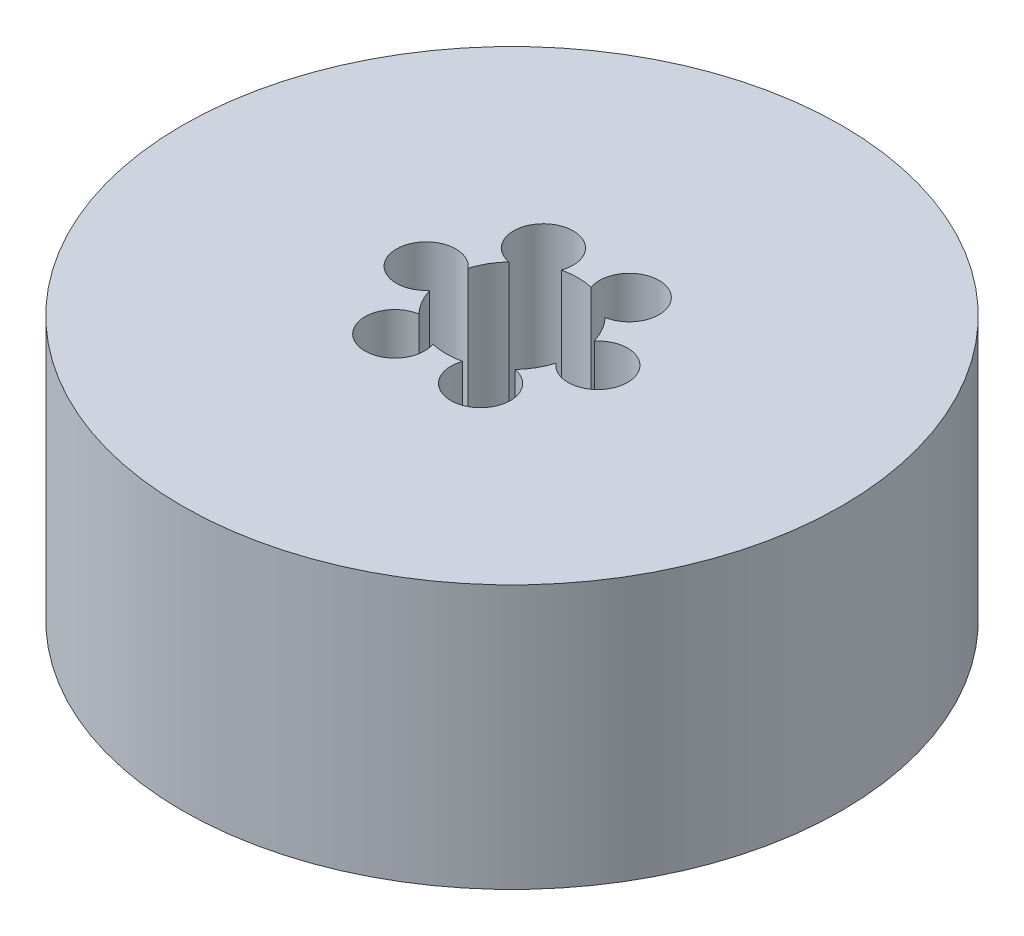
ISO-10303-21;
HEADER;
FILE_DESCRIPTION(('STEP AP214'),'2;1');
FILE_NAME('part.step','',(''),(''),'','','');
FILE_SCHEMA(('AUTOMOTIVE_DESIGN { 1 0 10303 214 1 1 1 1 }'));
ENDSEC;
DATA;
#1=APPLICATION_CONTEXT('core data for automotive mechanical design processes');
#2=APPLICATION_PROTOCOL_DEFINITION('international standard','automotive_design',2000,#1);
#3=PRODUCT_CONTEXT('',#1,'mechanical');
#4=PRODUCT('Part','Part','',(#3));
#5=PRODUCT_RELATED_PRODUCT_CATEGORY('part','',(#4));
#6=PRODUCT_DEFINITION_FORMATION('','',#4);
#7=PRODUCT_DEFINITION_CONTEXT('part definition',#1,'design');
#8=PRODUCT_DEFINITION('design','',#6,#7);
#9=PRODUCT_DEFINITION_SHAPE('','',#8);
#10=(LENGTH_UNIT() NAMED_UNIT(*) SI_UNIT(.MILLI.,.METRE.));
#11=(NAMED_UNIT(*) PLANE_ANGLE_UNIT() SI_UNIT($,.RADIAN.));
#12=(NAMED_UNIT(*) SI_UNIT($,.STERADIAN.) SOLID_ANGLE_UNIT());
#13=UNCERTAINTY_MEASURE_WITH_UNIT(LENGTH_MEASURE(1.E-05),#10,'distance_accuracy_value','');
#14=(GEOMETRIC_REPRESENTATION_CONTEXT(3) GLOBAL_UNCERTAINTY_ASSIGNED_CONTEXT((#13)) GLOBAL_UNIT_ASSIGNED_CONTEXT((#10,
#11,#12)) REPRESENTATION_CONTEXT('',''));
#15=CARTESIAN_POINT('',(0.,0.,0.));
#16=DIRECTION('',(0.,0.,1.));
#17=DIRECTION('',(1.,0.,0.));
#18=AXIS2_PLACEMENT_3D('',#15,#16,#17);
#19=CARTESIAN_POINT('',(0.,20.,0.));
#20=DIRECTION('',(0.,-1.,0.));
#21=DIRECTION('',(0.,0.,-1.));
#22=AXIS2_PLACEMENT_3D('',#19,#20,#21);
#23=CYLINDRICAL_SURFACE('',#22,25.);
#24=CARTESIAN_POINT('',(0.,20.,0.));
#25=DIRECTION('',(0.,1.,0.));
#26=DIRECTION('',(0.,0.,1.));
#27=AXIS2_PLACEMENT_3D('',#24,#25,#26);
#28=CIRCLE('',#27,25.);
#29=CARTESIAN_POINT('',(0.,20.,25.));
#30=VERTEX_POINT('',#29);
#31=EDGE_CURVE('E171',#30,#30,#28,.T.);
#32=ORIENTED_EDGE('',*,*,#31,.F.);
#33=EDGE_LOOP('',(#32));
#34=FACE_BOUND('',#33,.T.);
#35=CARTESIAN_POINT('',(0.,0.,0.));
#36=DIRECTION('',(0.,1.,0.));
#37=DIRECTION('',(0.,0.,1.));
#38=AXIS2_PLACEMENT_3D('',#35,#36,#37);
#39=CIRCLE('',#38,25.);
#40=CARTESIAN_POINT('',(0.,0.,25.));
#41=VERTEX_POINT('',#40);
#42=EDGE_CURVE('E157',#41,#41,#39,.T.);
#43=ORIENTED_EDGE('',*,*,#42,.T.);
#44=EDGE_LOOP('',(#43));
#45=FACE_BOUND('',#44,.T.);
#46=ADVANCED_FACE('F39',(#34,#45),#23,.T.);
#47=CARTESIAN_POINT('',(0.,20.,0.));
#48=DIRECTION('',(0.,1.,0.));
#49=DIRECTION('',(0.,0.,1.));
#50=AXIS2_PLACEMENT_3D('',#47,#48,#49);
#51=PLANE('',#50);
#52=CARTESIAN_POINT('',(-3.25438526965121,20.,-5.63676063443948));
#53=DIRECTION('',(0.,1.,0.));
#54=DIRECTION('',(-0.866025403784433,0.,0.50000000000001));
#55=AXIS2_PLACEMENT_3D('',#52,#53,#54);
#56=CIRCLE('',#55,2.25778985265546);
#57=CARTESIAN_POINT('',(-1.13060215816888,20.,-4.87049676726552));
#58=VERTEX_POINT('',#57);
#59=CARTESIAN_POINT('',(-3.65267285041757,20.,-3.41437857418043));
#60=VERTEX_POINT('',#59);
#61=EDGE_CURVE('E214',#58,#60,#56,.T.);
#62=ORIENTED_EDGE('',*,*,#61,.F.);
#63=CARTESIAN_POINT('',(0.,20.,0.));
#64=DIRECTION('',(0.,1.,0.));
#65=DIRECTION('',(0.,0.,1.));
#66=AXIS2_PLACEMENT_3D('',#63,#64,#65);
#67=CIRCLE('',#66,5.);
#68=CARTESIAN_POINT('',(1.13060215816877,20.,-4.87049676726554));
#69=VERTEX_POINT('',#68);
#70=EDGE_CURVE('E272',#69,#58,#67,.T.);
#71=ORIENTED_EDGE('',*,*,#70,.F.);
#72=CARTESIAN_POINT('',(3.25438526965109,20.,-5.63676063443955));
#73=DIRECTION('',(0.,1.,0.));
#74=DIRECTION('',(-0.866025403784443,0.,-0.499999999999992));
#75=AXIS2_PLACEMENT_3D('',#72,#73,#74);
#76=CIRCLE('',#75,2.25778985265546);
#77=CARTESIAN_POINT('',(3.6526728504175,20.,-3.41437857418051));
#78=VERTEX_POINT('',#77);
#79=EDGE_CURVE('E285',#78,#69,#76,.T.);
#80=ORIENTED_EDGE('',*,*,#79,.F.);
#81=CARTESIAN_POINT('',(4.78327500858635,20.,-1.45611819308506));
#82=VERTEX_POINT('',#81);
#83=EDGE_CURVE('E165',#82,#78,#67,.T.);
#84=ORIENTED_EDGE('',*,*,#83,.F.);
#85=CARTESIAN_POINT('',(6.50877053930228,20.,0.));
#86=DIRECTION('',(0.,1.,0.));
#87=DIRECTION('',(0.,0.,-1.));
#88=AXIS2_PLACEMENT_3D('',#85,#86,#87);
#89=CIRCLE('',#88,2.25778985265546);
#90=CARTESIAN_POINT('',(4.78327500858635,20.,1.45611819308506));
#91=VERTEX_POINT('',#90);
#92=EDGE_CURVE('E281',#91,#82,#89,.T.);
#93=ORIENTED_EDGE('',*,*,#92,.F.);
#94=CARTESIAN_POINT('',(3.65267285041754,20.,3.41437857418046));
#95=VERTEX_POINT('',#94);
#96=EDGE_CURVE('E160',#95,#91,#67,.T.);
#97=ORIENTED_EDGE('',*,*,#96,.F.);
#98=CARTESIAN_POINT('',(3.25438526965117,20.,5.6367606344395));
#99=DIRECTION('',(0.,1.,0.));
#100=DIRECTION('',(0.866025403784436,0.,-0.500000000000004));
#101=AXIS2_PLACEMENT_3D('',#98,#99,#100);
#102=CIRCLE('',#101,2.25778985265546);
#103=CARTESIAN_POINT('',(1.13060215816884,20.,4.87049676726553));
#104=VERTEX_POINT('',#103);
#105=EDGE_CURVE('E154',#104,#95,#102,.T.);
#106=ORIENTED_EDGE('',*,*,#105,.F.);
#107=CARTESIAN_POINT('',(-1.13060215816881,20.,4.87049676726554));
#108=VERTEX_POINT('',#107);
#109=EDGE_CURVE('E150',#108,#104,#67,.T.);
#110=ORIENTED_EDGE('',*,*,#109,.F.);
#111=CARTESIAN_POINT('',(-3.25438526965113,20.,5.63676063443952));
#112=DIRECTION('',(0.,1.,0.));
#113=DIRECTION('',(0.86602540378444,0.,0.499999999999998));
#114=AXIS2_PLACEMENT_3D('',#111,#112,#113);
#115=CIRCLE('',#114,2.25778985265546);
#116=CARTESIAN_POINT('',(-3.65267285041752,20.,3.41437857418048));
#117=VERTEX_POINT('',#116);
#118=EDGE_CURVE('E127',#117,#108,#115,.T.);
#119=ORIENTED_EDGE('',*,*,#118,.F.);
#120=CARTESIAN_POINT('',(-4.78327500858635,20.,1.45611819308506));
#121=VERTEX_POINT('',#120);
#122=EDGE_CURVE('E156',#121,#117,#67,.T.);
#123=ORIENTED_EDGE('',*,*,#122,.F.);
#124=CARTESIAN_POINT('',(-6.50877053930228,20.,0.));
#125=DIRECTION('',(0.,1.,0.));
#126=DIRECTION('',(0.,0.,1.));
#127=AXIS2_PLACEMENT_3D('',#124,#125,#126);
#128=CIRCLE('',#127,2.25778985265546);
#129=CARTESIAN_POINT('',(-4.78327500858635,20.,-1.45611819308506));
#130=VERTEX_POINT('',#129);
#131=EDGE_CURVE('E164',#130,#121,#128,.T.);
#132=ORIENTED_EDGE('',*,*,#131,.F.);
#133=EDGE_CURVE('E159',#60,#130,#67,.T.);
#134=ORIENTED_EDGE('',*,*,#133,.F.);
#135=EDGE_LOOP('',(#62,#71,#80,#84,#93,#97,#106,#110,#119,#123,#132,#134));
#136=FACE_BOUND('',#135,.T.);
#137=ORIENTED_EDGE('',*,*,#31,.T.);
#138=EDGE_LOOP('',(#137));
#139=FACE_BOUND('',#138,.T.);
#140=ADVANCED_FACE('F155',(#136,#139),#51,.T.);
#141=CARTESIAN_POINT('',(0.,0.,0.));
#142=DIRECTION('',(0.,1.,0.));
#143=DIRECTION('',(0.,0.,1.));
#144=AXIS2_PLACEMENT_3D('',#141,#142,#143);
#145=PLANE('',#144);
#146=CARTESIAN_POINT('',(0.,0.,0.));
#147=DIRECTION('',(0.,1.,0.));
#148=DIRECTION('',(0.,0.,1.));
#149=AXIS2_PLACEMENT_3D('',#146,#147,#148);
#150=CIRCLE('',#149,5.);
#151=CARTESIAN_POINT('',(0.,0.,5.));
#152=VERTEX_POINT('',#151);
#153=EDGE_CURVE('E170',#152,#152,#150,.T.);
#154=ORIENTED_EDGE('',*,*,#153,.T.);
#155=EDGE_LOOP('',(#154));
#156=FACE_BOUND('',#155,.T.);
#157=ORIENTED_EDGE('',*,*,#42,.F.);
#158=EDGE_LOOP('',(#157));
#159=FACE_BOUND('',#158,.T.);
#160=ADVANCED_FACE('F232',(#156,#159),#145,.F.);
#161=CARTESIAN_POINT('',(0.,20.,0.));
#162=DIRECTION('',(0.,-1.,0.));
#163=DIRECTION('',(0.,0.,-1.));
#164=AXIS2_PLACEMENT_3D('',#161,#162,#163);
#165=CYLINDRICAL_SURFACE('',#164,5.);
#166=DIRECTION('',(0.,1.,0.));
#167=VECTOR('',#166,1.);
#168=CARTESIAN_POINT('',(-1.13060215816888,12.9136360267751,-4.87049676726552));
#169=LINE('',#168,#167);
#170=CARTESIAN_POINT('',(-1.13060215816888,5.82727205355029,-4.87049676726552));
#171=VERTEX_POINT('',#170);
#172=EDGE_CURVE('E11',#171,#58,#169,.T.);
#173=ORIENTED_EDGE('',*,*,#172,.F.);
#174=CARTESIAN_POINT('',(0.,5.82727205355029,0.));
#175=DIRECTION('',(0.,1.,0.));
#176=DIRECTION('',(0.,0.,1.));
#177=AXIS2_PLACEMENT_3D('',#174,#175,#176);
#178=CIRCLE('',#177,5.);
#179=CARTESIAN_POINT('',(-3.65267285041757,5.82727205355029,-3.41437857418043));
#180=VERTEX_POINT('',#179);
#181=EDGE_CURVE('E209',#171,#180,#178,.T.);
#182=ORIENTED_EDGE('',*,*,#181,.T.);
#183=DIRECTION('',(0.,1.,0.));
#184=VECTOR('',#183,1.);
#185=CARTESIAN_POINT('',(-3.65267285041757,12.9136360267751,-3.41437857418043));
#186=LINE('',#185,#184);
#187=EDGE_CURVE('E46',#60,#180,#186,.F.);
#188=ORIENTED_EDGE('',*,*,#187,.F.);
#189=ORIENTED_EDGE('',*,*,#133,.T.);
#190=DIRECTION('',(0.,1.,0.));
#191=VECTOR('',#190,1.);
#192=CARTESIAN_POINT('',(-4.78327500858635,12.9136360267751,-1.45611819308506));
#193=LINE('',#192,#191);
#194=CARTESIAN_POINT('',(-4.78327500858635,5.82727205355029,-1.45611819308506));
#195=VERTEX_POINT('',#194);
#196=EDGE_CURVE('E185',#195,#130,#193,.T.);
#197=ORIENTED_EDGE('',*,*,#196,.F.);
#198=CARTESIAN_POINT('',(0.,5.82727205355029,0.));
#199=DIRECTION('',(0.,1.,0.));
#200=DIRECTION('',(0.,0.,1.));
#201=AXIS2_PLACEMENT_3D('',#198,#199,#200);
#202=CIRCLE('',#201,5.);
#203=CARTESIAN_POINT('',(-4.78327500858635,5.82727205355029,1.45611819308506));
#204=VERTEX_POINT('',#203);
#205=EDGE_CURVE('E173',#195,#204,#202,.T.);
#206=ORIENTED_EDGE('',*,*,#205,.T.);
#207=DIRECTION('',(0.,1.,0.));
#208=VECTOR('',#207,1.);
#209=CARTESIAN_POINT('',(-4.78327500858635,12.9136360267751,1.45611819308506));
#210=LINE('',#209,#208);
#211=EDGE_CURVE('E178',#121,#204,#210,.F.);
#212=ORIENTED_EDGE('',*,*,#211,.F.);
#213=ORIENTED_EDGE('',*,*,#122,.T.);
#214=DIRECTION('',(0.,1.,0.));
#215=VECTOR('',#214,1.);
#216=CARTESIAN_POINT('',(-3.65267285041752,12.9136360267751,3.41437857418048));
#217=LINE('',#216,#215);
#218=CARTESIAN_POINT('',(-3.65267285041752,5.82727205355029,3.41437857418048));
#219=VERTEX_POINT('',#218);
#220=EDGE_CURVE('E132',#219,#117,#217,.T.);
#221=ORIENTED_EDGE('',*,*,#220,.F.);
#222=CARTESIAN_POINT('',(0.,5.82727205355029,0.));
#223=DIRECTION('',(0.,1.,0.));
#224=DIRECTION('',(0.,0.,1.));
#225=AXIS2_PLACEMENT_3D('',#222,#223,#224);
#226=CIRCLE('',#225,5.);
#227=CARTESIAN_POINT('',(-1.13060215816881,5.82727205355029,4.87049676726554));
#228=VERTEX_POINT('',#227);
#229=EDGE_CURVE('E146',#219,#228,#226,.T.);
#230=ORIENTED_EDGE('',*,*,#229,.T.);
#231=DIRECTION('',(0.,1.,0.));
#232=VECTOR('',#231,1.);
#233=CARTESIAN_POINT('',(-1.13060215816881,12.9136360267751,4.87049676726554));
#234=LINE('',#233,#232);
#235=EDGE_CURVE('E128',#108,#228,#234,.F.);
#236=ORIENTED_EDGE('',*,*,#235,.F.);
#237=ORIENTED_EDGE('',*,*,#109,.T.);
#238=DIRECTION('',(0.,1.,0.));
#239=VECTOR('',#238,1.);
#240=CARTESIAN_POINT('',(1.13060215816884,12.9136360267751,4.87049676726553));
#241=LINE('',#240,#239);
#242=CARTESIAN_POINT('',(1.13060215816884,5.82727205355029,4.87049676726553));
#243=VERTEX_POINT('',#242);
#244=EDGE_CURVE('E192',#243,#104,#241,.T.);
#245=ORIENTED_EDGE('',*,*,#244,.F.);
#246=CARTESIAN_POINT('',(0.,5.82727205355029,0.));
#247=DIRECTION('',(0.,1.,0.));
#248=DIRECTION('',(0.,0.,1.));
#249=AXIS2_PLACEMENT_3D('',#246,#247,#248);
#250=CIRCLE('',#249,5.);
#251=CARTESIAN_POINT('',(3.65267285041754,5.82727205355029,3.41437857418046));
#252=VERTEX_POINT('',#251);
#253=EDGE_CURVE('E190',#243,#252,#250,.T.);
#254=ORIENTED_EDGE('',*,*,#253,.T.);
#255=DIRECTION('',(0.,1.,0.));
#256=VECTOR('',#255,1.);
#257=CARTESIAN_POINT('',(3.65267285041754,12.9136360267751,3.41437857418046));
#258=LINE('',#257,#256);
#259=EDGE_CURVE('E189',#95,#252,#258,.F.);
#260=ORIENTED_EDGE('',*,*,#259,.F.);
#261=ORIENTED_EDGE('',*,*,#96,.T.);
#262=DIRECTION('',(0.,1.,0.));
#263=VECTOR('',#262,1.);
#264=CARTESIAN_POINT('',(4.78327500858635,12.9136360267751,1.45611819308506));
#265=LINE('',#264,#263);
#266=CARTESIAN_POINT('',(4.78327500858635,5.82727205355029,1.45611819308506));
#267=VERTEX_POINT('',#266);
#268=EDGE_CURVE('E203',#267,#91,#265,.T.);
#269=ORIENTED_EDGE('',*,*,#268,.F.);
#270=CARTESIAN_POINT('',(0.,5.82727205355029,0.));
#271=DIRECTION('',(0.,1.,0.));
#272=DIRECTION('',(0.,0.,1.));
#273=AXIS2_PLACEMENT_3D('',#270,#271,#272);
#274=CIRCLE('',#273,5.);
#275=CARTESIAN_POINT('',(4.78327500858635,5.82727205355029,-1.45611819308506));
#276=VERTEX_POINT('',#275);
#277=EDGE_CURVE('E194',#267,#276,#274,.T.);
#278=ORIENTED_EDGE('',*,*,#277,.T.);
#279=DIRECTION('',(0.,1.,0.));
#280=VECTOR('',#279,1.);
#281=CARTESIAN_POINT('',(4.78327500858635,12.9136360267751,-1.45611819308506));
#282=LINE('',#281,#280);
#283=EDGE_CURVE('E196',#82,#276,#282,.F.);
#284=ORIENTED_EDGE('',*,*,#283,.F.);
#285=ORIENTED_EDGE('',*,*,#83,.T.);
#286=DIRECTION('',(0.,1.,0.));
#287=VECTOR('',#286,1.);
#288=CARTESIAN_POINT('',(3.6526728504175,12.9136360267751,-3.41437857418051));
#289=LINE('',#288,#287);
#290=CARTESIAN_POINT('',(3.6526728504175,5.82727205355029,-3.41437857418051));
#291=VERTEX_POINT('',#290);
#292=EDGE_CURVE('E208',#291,#78,#289,.T.);
#293=ORIENTED_EDGE('',*,*,#292,.F.);
#294=CARTESIAN_POINT('',(0.,5.82727205355029,0.));
#295=DIRECTION('',(0.,1.,0.));
#296=DIRECTION('',(0.,0.,1.));
#297=AXIS2_PLACEMENT_3D('',#294,#295,#296);
#298=CIRCLE('',#297,5.);
#299=CARTESIAN_POINT('',(1.13060215816877,5.82727205355029,-4.87049676726554));
#300=VERTEX_POINT('',#299);
#301=EDGE_CURVE('E201',#291,#300,#298,.T.);
#302=ORIENTED_EDGE('',*,*,#301,.T.);
#303=DIRECTION('',(0.,1.,0.));
#304=VECTOR('',#303,1.);
#305=CARTESIAN_POINT('',(1.13060215816877,12.9136360267751,-4.87049676726554));
#306=LINE('',#305,#304);
#307=EDGE_CURVE('E206',#69,#300,#306,.F.);
#308=ORIENTED_EDGE('',*,*,#307,.F.);
#309=ORIENTED_EDGE('',*,*,#70,.T.);
#310=EDGE_LOOP('',(#173,#182,#188,#189,#197,#206,#212,#213,#221,#230,#236,#237,#245,#254,#260,
#261,#269,#278,#284,#285,#293,#302,#308,#309));
#311=FACE_BOUND('',#310,.T.);
#312=ORIENTED_EDGE('',*,*,#153,.F.);
#313=EDGE_LOOP('',(#312));
#314=FACE_BOUND('',#313,.T.);
#315=ADVANCED_FACE('F145',(#311,#314),#165,.F.);
#316=CARTESIAN_POINT('',(-6.50877053930228,5.82727205355029,0.));
#317=DIRECTION('',(0.,1.,0.));
#318=DIRECTION('',(0.,0.,1.));
#319=AXIS2_PLACEMENT_3D('',#316,#317,#318);
#320=CYLINDRICAL_SURFACE('',#319,2.25778985265546);
#321=ORIENTED_EDGE('',*,*,#196,.T.);
#322=ORIENTED_EDGE('',*,*,#131,.T.);
#323=ORIENTED_EDGE('',*,*,#211,.T.);
#324=CARTESIAN_POINT('',(-6.50877053930228,5.82727205355029,0.));
#325=DIRECTION('',(0.,1.,0.));
#326=DIRECTION('',(0.,0.,1.));
#327=AXIS2_PLACEMENT_3D('',#324,#325,#326);
#328=CIRCLE('',#327,2.25778985265546);
#329=EDGE_CURVE('E168',#195,#204,#328,.T.);
#330=ORIENTED_EDGE('',*,*,#329,.F.);
#331=EDGE_LOOP('',(#321,#322,#323,#330));
#332=FACE_BOUND('',#331,.T.);
#333=ADVANCED_FACE('F243',(#332),#320,.F.);
#334=CARTESIAN_POINT('',(-6.50877053930228,5.82727205355029,0.));
#335=DIRECTION('',(0.,1.,0.));
#336=DIRECTION('',(0.,0.,1.));
#337=AXIS2_PLACEMENT_3D('',#334,#335,#336);
#338=PLANE('',#337);
#339=ORIENTED_EDGE('',*,*,#329,.T.);
#340=ORIENTED_EDGE('',*,*,#205,.F.);
#341=EDGE_LOOP('',(#339,#340));
#342=FACE_BOUND('',#341,.T.);
#343=ADVANCED_FACE('F247',(#342),#338,.T.);
#344=CARTESIAN_POINT('',(-3.25438526965113,5.82727205355029,5.63676063443952));
#345=DIRECTION('',(0.,1.,0.));
#346=DIRECTION('',(0.,0.,1.));
#347=AXIS2_PLACEMENT_3D('',#344,#345,#346);
#348=CYLINDRICAL_SURFACE('',#347,2.25778985265546);
#349=ORIENTED_EDGE('',*,*,#220,.T.);
#350=ORIENTED_EDGE('',*,*,#118,.T.);
#351=ORIENTED_EDGE('',*,*,#235,.T.);
#352=CARTESIAN_POINT('',(-3.25438526965113,5.82727205355029,5.63676063443952));
#353=DIRECTION('',(0.,1.,0.));
#354=DIRECTION('',(0.86602540378444,0.,0.499999999999998));
#355=AXIS2_PLACEMENT_3D('',#352,#353,#354);
#356=CIRCLE('',#355,2.25778985265546);
#357=EDGE_CURVE('E137',#219,#228,#356,.T.);
#358=ORIENTED_EDGE('',*,*,#357,.F.);
#359=EDGE_LOOP('',(#349,#350,#351,#358));
#360=FACE_BOUND('',#359,.T.);
#361=ADVANCED_FACE('F126',(#360),#348,.F.);
#362=CARTESIAN_POINT('',(-3.25438526965113,5.82727205355029,5.63676063443952));
#363=DIRECTION('',(0.,1.,0.));
#364=DIRECTION('',(0.86602540378444,0.,0.499999999999998));
#365=AXIS2_PLACEMENT_3D('',#362,#363,#364);
#366=PLANE('',#365);
#367=ORIENTED_EDGE('',*,*,#357,.T.);
#368=ORIENTED_EDGE('',*,*,#229,.F.);
#369=EDGE_LOOP('',(#367,#368));
#370=FACE_BOUND('',#369,.T.);
#371=ADVANCED_FACE('F254',(#370),#366,.T.);
#372=CARTESIAN_POINT('',(3.25438526965117,5.82727205355029,5.6367606344395));
#373=DIRECTION('',(0.,1.,0.));
#374=DIRECTION('',(0.,0.,1.));
#375=AXIS2_PLACEMENT_3D('',#372,#373,#374);
#376=CYLINDRICAL_SURFACE('',#375,2.25778985265546);
#377=ORIENTED_EDGE('',*,*,#244,.T.);
#378=ORIENTED_EDGE('',*,*,#105,.T.);
#379=ORIENTED_EDGE('',*,*,#259,.T.);
#380=CARTESIAN_POINT('',(3.25438526965117,5.82727205355029,5.6367606344395));
#381=DIRECTION('',(0.,1.,0.));
#382=DIRECTION('',(0.866025403784436,0.,-0.500000000000004));
#383=AXIS2_PLACEMENT_3D('',#380,#381,#382);
#384=CIRCLE('',#383,2.25778985265546);
#385=EDGE_CURVE('E138',#243,#252,#384,.T.);
#386=ORIENTED_EDGE('',*,*,#385,.F.);
#387=EDGE_LOOP('',(#377,#378,#379,#386));
#388=FACE_BOUND('',#387,.T.);
#389=ADVANCED_FACE('F260',(#388),#376,.F.);
#390=CARTESIAN_POINT('',(3.25438526965117,5.82727205355029,5.6367606344395));
#391=DIRECTION('',(0.,1.,0.));
#392=DIRECTION('',(0.866025403784436,0.,-0.500000000000004));
#393=AXIS2_PLACEMENT_3D('',#390,#391,#392);
#394=PLANE('',#393);
#395=ORIENTED_EDGE('',*,*,#385,.T.);
#396=ORIENTED_EDGE('',*,*,#253,.F.);
#397=EDGE_LOOP('',(#395,#396));
#398=FACE_BOUND('',#397,.T.);
#399=ADVANCED_FACE('F265',(#398),#394,.T.);
#400=CARTESIAN_POINT('',(6.50877053930228,5.82727205355029,0.));
#401=DIRECTION('',(0.,1.,0.));
#402=DIRECTION('',(0.,0.,1.));
#403=AXIS2_PLACEMENT_3D('',#400,#401,#402);
#404=CYLINDRICAL_SURFACE('',#403,2.25778985265546);
#405=ORIENTED_EDGE('',*,*,#268,.T.);
#406=ORIENTED_EDGE('',*,*,#92,.T.);
#407=ORIENTED_EDGE('',*,*,#283,.T.);
#408=CARTESIAN_POINT('',(6.50877053930228,5.82727205355029,0.));
#409=DIRECTION('',(0.,1.,0.));
#410=DIRECTION('',(0.,0.,-1.));
#411=AXIS2_PLACEMENT_3D('',#408,#409,#410);
#412=CIRCLE('',#411,2.25778985265546);
#413=EDGE_CURVE('E287',#267,#276,#412,.T.);
#414=ORIENTED_EDGE('',*,*,#413,.F.);
#415=EDGE_LOOP('',(#405,#406,#407,#414));
#416=FACE_BOUND('',#415,.T.);
#417=ADVANCED_FACE('F300',(#416),#404,.F.);
#418=CARTESIAN_POINT('',(6.50877053930228,5.82727205355029,0.));
#419=DIRECTION('',(0.,1.,0.));
#420=DIRECTION('',(0.,0.,-1.));
#421=AXIS2_PLACEMENT_3D('',#418,#419,#420);
#422=PLANE('',#421);
#423=ORIENTED_EDGE('',*,*,#413,.T.);
#424=ORIENTED_EDGE('',*,*,#277,.F.);
#425=EDGE_LOOP('',(#423,#424));
#426=FACE_BOUND('',#425,.T.);
#427=ADVANCED_FACE('F298',(#426),#422,.T.);
#428=CARTESIAN_POINT('',(3.25438526965109,5.82727205355029,-5.63676063443955));
#429=DIRECTION('',(0.,1.,0.));
#430=DIRECTION('',(0.,0.,1.));
#431=AXIS2_PLACEMENT_3D('',#428,#429,#430);
#432=CYLINDRICAL_SURFACE('',#431,2.25778985265546);
#433=ORIENTED_EDGE('',*,*,#292,.T.);
#434=ORIENTED_EDGE('',*,*,#79,.T.);
#435=ORIENTED_EDGE('',*,*,#307,.T.);
#436=CARTESIAN_POINT('',(3.25438526965109,5.82727205355029,-5.63676063443955));
#437=DIRECTION('',(0.,1.,0.));
#438=DIRECTION('',(-0.866025403784443,0.,-0.499999999999992));
#439=AXIS2_PLACEMENT_3D('',#436,#437,#438);
#440=CIRCLE('',#439,2.25778985265546);
#441=EDGE_CURVE('E56',#291,#300,#440,.T.);
#442=ORIENTED_EDGE('',*,*,#441,.F.);
#443=EDGE_LOOP('',(#433,#434,#435,#442));
#444=FACE_BOUND('',#443,.T.);
#445=ADVANCED_FACE('F301',(#444),#432,.F.);
#446=CARTESIAN_POINT('',(3.25438526965109,5.82727205355029,-5.63676063443955));
#447=DIRECTION('',(0.,1.,0.));
#448=DIRECTION('',(-0.866025403784443,0.,-0.499999999999992));
#449=AXIS2_PLACEMENT_3D('',#446,#447,#448);
#450=PLANE('',#449);
#451=ORIENTED_EDGE('',*,*,#441,.T.);
#452=ORIENTED_EDGE('',*,*,#301,.F.);
#453=EDGE_LOOP('',(#451,#452));
#454=FACE_BOUND('',#453,.T.);
#455=ADVANCED_FACE('F221',(#454),#450,.T.);
#456=CARTESIAN_POINT('',(-3.25438526965121,5.82727205355029,-5.63676063443948));
#457=DIRECTION('',(0.,1.,0.));
#458=DIRECTION('',(0.,0.,1.));
#459=AXIS2_PLACEMENT_3D('',#456,#457,#458);
#460=CYLINDRICAL_SURFACE('',#459,2.25778985265546);
#461=ORIENTED_EDGE('',*,*,#172,.T.);
#462=ORIENTED_EDGE('',*,*,#61,.T.);
#463=ORIENTED_EDGE('',*,*,#187,.T.);
#464=CARTESIAN_POINT('',(-3.25438526965121,5.82727205355029,-5.63676063443948));
#465=DIRECTION('',(0.,1.,0.));
#466=DIRECTION('',(-0.866025403784433,0.,0.50000000000001));
#467=AXIS2_PLACEMENT_3D('',#464,#465,#466);
#468=CIRCLE('',#467,2.25778985265546);
#469=EDGE_CURVE('E55',#171,#180,#468,.T.);
#470=ORIENTED_EDGE('',*,*,#469,.F.);
#471=EDGE_LOOP('',(#461,#462,#463,#470));
#472=FACE_BOUND('',#471,.T.);
#473=ADVANCED_FACE('F212',(#472),#460,.F.);
#474=CARTESIAN_POINT('',(-3.25438526965121,5.82727205355029,-5.63676063443948));
#475=DIRECTION('',(0.,1.,0.));
#476=DIRECTION('',(-0.866025403784433,0.,0.50000000000001));
#477=AXIS2_PLACEMENT_3D('',#474,#475,#476);
#478=PLANE('',#477);
#479=ORIENTED_EDGE('',*,*,#469,.T.);
#480=ORIENTED_EDGE('',*,*,#181,.F.);
#481=EDGE_LOOP('',(#479,#480));
#482=FACE_BOUND('',#481,.T.);
#483=ADVANCED_FACE('F217',(#482),#478,.T.);
#484=CLOSED_SHELL('',(#46,#140,#160,#315,#333,#343,#361,#371,#389,#399,#417,#427,#445,#455,#473,#483));
#485=MANIFOLD_SOLID_BREP('B2',#484);
#486=ADVANCED_BREP_SHAPE_REPRESENTATION('',(#18,#485),#14);
#487=SHAPE_DEFINITION_REPRESENTATION(#9,#486);
ENDSEC;
END-ISO-10303-21;
